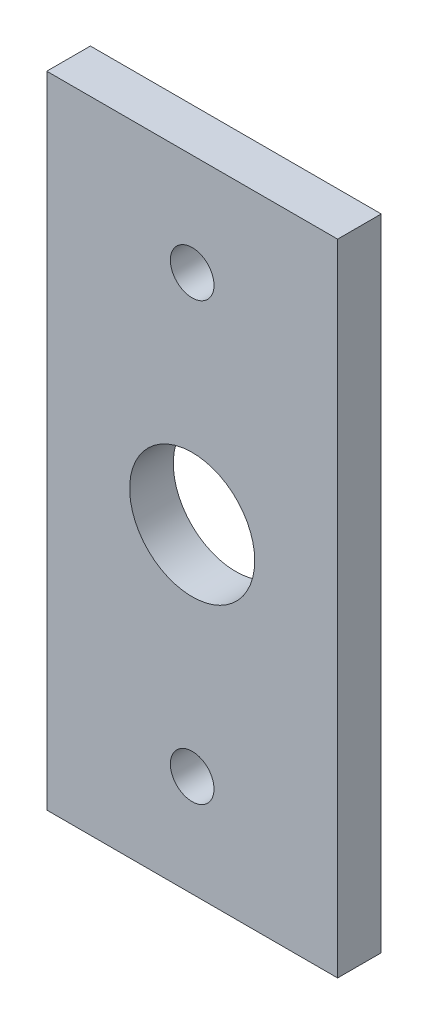
ISO-10303-21;
HEADER;
FILE_DESCRIPTION(('STEP AP214'),'2;1');
FILE_NAME('part.step','',(''),(''),'','','');
FILE_SCHEMA(('AUTOMOTIVE_DESIGN { 1 0 10303 214 1 1 1 1 }'));
ENDSEC;
DATA;
#1=APPLICATION_CONTEXT('core data for automotive mechanical design processes');
#2=APPLICATION_PROTOCOL_DEFINITION('international standard','automotive_design',2000,#1);
#3=PRODUCT_CONTEXT('',#1,'mechanical');
#4=PRODUCT('Part','Part','',(#3));
#5=PRODUCT_RELATED_PRODUCT_CATEGORY('part','',(#4));
#6=PRODUCT_DEFINITION_FORMATION('','',#4);
#7=PRODUCT_DEFINITION_CONTEXT('part definition',#1,'design');
#8=PRODUCT_DEFINITION('design','',#6,#7);
#9=PRODUCT_DEFINITION_SHAPE('','',#8);
#10=(LENGTH_UNIT() NAMED_UNIT(*) SI_UNIT(.MILLI.,.METRE.));
#11=(NAMED_UNIT(*) PLANE_ANGLE_UNIT() SI_UNIT($,.RADIAN.));
#12=(NAMED_UNIT(*) SI_UNIT($,.STERADIAN.) SOLID_ANGLE_UNIT());
#13=UNCERTAINTY_MEASURE_WITH_UNIT(LENGTH_MEASURE(1.E-05),#10,'distance_accuracy_value','');
#14=(GEOMETRIC_REPRESENTATION_CONTEXT(3) GLOBAL_UNCERTAINTY_ASSIGNED_CONTEXT((#13)) GLOBAL_UNIT_ASSIGNED_CONTEXT((#10,
#11,#12)) REPRESENTATION_CONTEXT('',''));
#15=CARTESIAN_POINT('',(0.,0.,0.));
#16=DIRECTION('',(0.,0.,1.));
#17=DIRECTION('',(1.,0.,0.));
#18=AXIS2_PLACEMENT_3D('',#15,#16,#17);
#19=CARTESIAN_POINT('',(0.,0.,3.));
#20=DIRECTION('',(0.,0.,1.));
#21=DIRECTION('',(1.,0.,0.));
#22=AXIS2_PLACEMENT_3D('',#19,#20,#21);
#23=PLANE('',#22);
#24=CARTESIAN_POINT('',(10.,-37.,3.));
#25=DIRECTION('',(0.,0.,1.));
#26=DIRECTION('',(1.,0.,0.));
#27=AXIS2_PLACEMENT_3D('',#24,#25,#26);
#28=CIRCLE('',#27,1.5);
#29=CARTESIAN_POINT('',(11.5,-37.,3.));
#30=VERTEX_POINT('',#29);
#31=EDGE_CURVE('E117',#30,#30,#28,.T.);
#32=ORIENTED_EDGE('',*,*,#31,.F.);
#33=EDGE_LOOP('',(#32));
#34=FACE_BOUND('',#33,.T.);
#35=DIRECTION('',(0.,-1.,0.));
#36=VECTOR('',#35,1.);
#37=CARTESIAN_POINT('',(0.,0.,3.));
#38=LINE('',#37,#36);
#39=CARTESIAN_POINT('',(0.,0.,3.));
#40=VERTEX_POINT('',#39);
#41=CARTESIAN_POINT('',(0.,-44.,3.));
#42=VERTEX_POINT('',#41);
#43=EDGE_CURVE('E87',#40,#42,#38,.T.);
#44=ORIENTED_EDGE('',*,*,#43,.T.);
#45=DIRECTION('',(1.,0.,0.));
#46=VECTOR('',#45,1.);
#47=CARTESIAN_POINT('',(0.,-44.,3.));
#48=LINE('',#47,#46);
#49=CARTESIAN_POINT('',(20.,-44.,3.));
#50=VERTEX_POINT('',#49);
#51=EDGE_CURVE('E82',#42,#50,#48,.T.);
#52=ORIENTED_EDGE('',*,*,#51,.T.);
#53=DIRECTION('',(0.,1.,0.));
#54=VECTOR('',#53,1.);
#55=CARTESIAN_POINT('',(20.,0.,3.));
#56=LINE('',#55,#54);
#57=CARTESIAN_POINT('',(20.,0.,3.));
#58=VERTEX_POINT('',#57);
#59=EDGE_CURVE('E85',#50,#58,#56,.T.);
#60=ORIENTED_EDGE('',*,*,#59,.T.);
#61=DIRECTION('',(-1.,0.,0.));
#62=VECTOR('',#61,1.);
#63=CARTESIAN_POINT('',(0.,0.,3.));
#64=LINE('',#63,#62);
#65=EDGE_CURVE('E52',#58,#40,#64,.T.);
#66=ORIENTED_EDGE('',*,*,#65,.T.);
#67=EDGE_LOOP('',(#44,#52,#60,#66));
#68=FACE_BOUND('',#67,.T.);
#69=CARTESIAN_POINT('',(10.,-7.,3.));
#70=DIRECTION('',(0.,0.,1.));
#71=DIRECTION('',(1.,0.,0.));
#72=AXIS2_PLACEMENT_3D('',#69,#70,#71);
#73=CIRCLE('',#72,1.5);
#74=CARTESIAN_POINT('',(11.5,-7.,3.));
#75=VERTEX_POINT('',#74);
#76=EDGE_CURVE('E102',#75,#75,#73,.T.);
#77=ORIENTED_EDGE('',*,*,#76,.F.);
#78=EDGE_LOOP('',(#77));
#79=FACE_BOUND('',#78,.T.);
#80=CARTESIAN_POINT('',(10.,-22.,3.));
#81=DIRECTION('',(0.,0.,1.));
#82=DIRECTION('',(1.,0.,0.));
#83=AXIS2_PLACEMENT_3D('',#80,#81,#82);
#84=CIRCLE('',#83,4.3);
#85=CARTESIAN_POINT('',(14.3,-22.,3.));
#86=VERTEX_POINT('',#85);
#87=EDGE_CURVE('E123',#86,#86,#84,.T.);
#88=ORIENTED_EDGE('',*,*,#87,.F.);
#89=EDGE_LOOP('',(#88));
#90=FACE_BOUND('',#89,.T.);
#91=ADVANCED_FACE('F35',(#34,#68,#79,#90),#23,.T.);
#92=CARTESIAN_POINT('',(0.,0.,0.));
#93=DIRECTION('',(0.,0.,1.));
#94=DIRECTION('',(1.,0.,0.));
#95=AXIS2_PLACEMENT_3D('',#92,#93,#94);
#96=PLANE('',#95);
#97=CARTESIAN_POINT('',(10.,-37.,0.));
#98=DIRECTION('',(0.,0.,1.));
#99=DIRECTION('',(1.,0.,0.));
#100=AXIS2_PLACEMENT_3D('',#97,#98,#99);
#101=CIRCLE('',#100,1.5);
#102=CARTESIAN_POINT('',(11.5,-37.,0.));
#103=VERTEX_POINT('',#102);
#104=EDGE_CURVE('E120',#103,#103,#101,.T.);
#105=ORIENTED_EDGE('',*,*,#104,.T.);
#106=EDGE_LOOP('',(#105));
#107=FACE_BOUND('',#106,.T.);
#108=DIRECTION('',(0.,-1.,0.));
#109=VECTOR('',#108,1.);
#110=CARTESIAN_POINT('',(0.,0.,0.));
#111=LINE('',#110,#109);
#112=CARTESIAN_POINT('',(0.,0.,0.));
#113=VERTEX_POINT('',#112);
#114=CARTESIAN_POINT('',(0.,-44.,0.));
#115=VERTEX_POINT('',#114);
#116=EDGE_CURVE('E99',#113,#115,#111,.T.);
#117=ORIENTED_EDGE('',*,*,#116,.F.);
#118=DIRECTION('',(-1.,0.,0.));
#119=VECTOR('',#118,1.);
#120=CARTESIAN_POINT('',(0.,0.,0.));
#121=LINE('',#120,#119);
#122=CARTESIAN_POINT('',(20.,0.,0.));
#123=VERTEX_POINT('',#122);
#124=EDGE_CURVE('E75',#123,#113,#121,.T.);
#125=ORIENTED_EDGE('',*,*,#124,.F.);
#126=DIRECTION('',(0.,1.,0.));
#127=VECTOR('',#126,1.);
#128=CARTESIAN_POINT('',(20.,0.,0.));
#129=LINE('',#128,#127);
#130=CARTESIAN_POINT('',(20.,-44.,0.));
#131=VERTEX_POINT('',#130);
#132=EDGE_CURVE('E69',#131,#123,#129,.T.);
#133=ORIENTED_EDGE('',*,*,#132,.F.);
#134=DIRECTION('',(1.,0.,0.));
#135=VECTOR('',#134,1.);
#136=CARTESIAN_POINT('',(0.,-44.,0.));
#137=LINE('',#136,#135);
#138=EDGE_CURVE('E91',#115,#131,#137,.T.);
#139=ORIENTED_EDGE('',*,*,#138,.F.);
#140=EDGE_LOOP('',(#117,#125,#133,#139));
#141=FACE_BOUND('',#140,.T.);
#142=CARTESIAN_POINT('',(10.,-7.,0.));
#143=DIRECTION('',(0.,0.,1.));
#144=DIRECTION('',(1.,0.,0.));
#145=AXIS2_PLACEMENT_3D('',#142,#143,#144);
#146=CIRCLE('',#145,1.5);
#147=CARTESIAN_POINT('',(11.5,-7.,0.));
#148=VERTEX_POINT('',#147);
#149=EDGE_CURVE('E114',#148,#148,#146,.T.);
#150=ORIENTED_EDGE('',*,*,#149,.T.);
#151=EDGE_LOOP('',(#150));
#152=FACE_BOUND('',#151,.T.);
#153=CARTESIAN_POINT('',(10.,-22.,0.));
#154=DIRECTION('',(0.,0.,1.));
#155=DIRECTION('',(1.,0.,0.));
#156=AXIS2_PLACEMENT_3D('',#153,#154,#155);
#157=CIRCLE('',#156,4.3);
#158=CARTESIAN_POINT('',(14.3,-22.,0.));
#159=VERTEX_POINT('',#158);
#160=EDGE_CURVE('E126',#159,#159,#157,.T.);
#161=ORIENTED_EDGE('',*,*,#160,.T.);
#162=EDGE_LOOP('',(#161));
#163=FACE_BOUND('',#162,.T.);
#164=ADVANCED_FACE('F110',(#107,#141,#152,#163),#96,.F.);
#165=CARTESIAN_POINT('',(0.,0.,3.));
#166=DIRECTION('',(1.,0.,0.));
#167=DIRECTION('',(0.,1.,0.));
#168=AXIS2_PLACEMENT_3D('',#165,#166,#167);
#169=PLANE('',#168);
#170=ORIENTED_EDGE('',*,*,#116,.T.);
#171=DIRECTION('',(0.,0.,-1.));
#172=VECTOR('',#171,1.);
#173=CARTESIAN_POINT('',(0.,-44.,3.));
#174=LINE('',#173,#172);
#175=EDGE_CURVE('E11',#42,#115,#174,.T.);
#176=ORIENTED_EDGE('',*,*,#175,.F.);
#177=ORIENTED_EDGE('',*,*,#43,.F.);
#178=DIRECTION('',(0.,0.,-1.));
#179=VECTOR('',#178,1.);
#180=CARTESIAN_POINT('',(0.,0.,3.));
#181=LINE('',#180,#179);
#182=EDGE_CURVE('E95',#40,#113,#181,.T.);
#183=ORIENTED_EDGE('',*,*,#182,.T.);
#184=EDGE_LOOP('',(#170,#176,#177,#183));
#185=FACE_BOUND('',#184,.T.);
#186=ADVANCED_FACE('F37',(#185),#169,.F.);
#187=CARTESIAN_POINT('',(0.,-44.,3.));
#188=DIRECTION('',(0.,1.,0.));
#189=DIRECTION('',(0.,0.,1.));
#190=AXIS2_PLACEMENT_3D('',#187,#188,#189);
#191=PLANE('',#190);
#192=ORIENTED_EDGE('',*,*,#138,.T.);
#193=DIRECTION('',(0.,0.,-1.));
#194=VECTOR('',#193,1.);
#195=CARTESIAN_POINT('',(20.,-44.,3.));
#196=LINE('',#195,#194);
#197=EDGE_CURVE('E44',#50,#131,#196,.T.);
#198=ORIENTED_EDGE('',*,*,#197,.F.);
#199=ORIENTED_EDGE('',*,*,#51,.F.);
#200=ORIENTED_EDGE('',*,*,#175,.T.);
#201=EDGE_LOOP('',(#192,#198,#199,#200));
#202=FACE_BOUND('',#201,.T.);
#203=ADVANCED_FACE('F90',(#202),#191,.F.);
#204=CARTESIAN_POINT('',(20.,0.,3.));
#205=DIRECTION('',(-1.,0.,0.));
#206=DIRECTION('',(0.,-1.,0.));
#207=AXIS2_PLACEMENT_3D('',#204,#205,#206);
#208=PLANE('',#207);
#209=ORIENTED_EDGE('',*,*,#132,.T.);
#210=DIRECTION('',(0.,0.,-1.));
#211=VECTOR('',#210,1.);
#212=CARTESIAN_POINT('',(20.,0.,3.));
#213=LINE('',#212,#211);
#214=EDGE_CURVE('E92',#58,#123,#213,.T.);
#215=ORIENTED_EDGE('',*,*,#214,.F.);
#216=ORIENTED_EDGE('',*,*,#59,.F.);
#217=ORIENTED_EDGE('',*,*,#197,.T.);
#218=EDGE_LOOP('',(#209,#215,#216,#217));
#219=FACE_BOUND('',#218,.T.);
#220=ADVANCED_FACE('F93',(#219),#208,.F.);
#221=CARTESIAN_POINT('',(0.,0.,3.));
#222=DIRECTION('',(0.,-1.,0.));
#223=DIRECTION('',(0.,0.,-1.));
#224=AXIS2_PLACEMENT_3D('',#221,#222,#223);
#225=PLANE('',#224);
#226=ORIENTED_EDGE('',*,*,#124,.T.);
#227=ORIENTED_EDGE('',*,*,#182,.F.);
#228=ORIENTED_EDGE('',*,*,#65,.F.);
#229=ORIENTED_EDGE('',*,*,#214,.T.);
#230=EDGE_LOOP('',(#226,#227,#228,#229));
#231=FACE_BOUND('',#230,.T.);
#232=ADVANCED_FACE('F107',(#231),#225,.F.);
#233=CARTESIAN_POINT('',(10.,-7.,3.));
#234=DIRECTION('',(0.,0.,-1.));
#235=DIRECTION('',(-1.,0.,0.));
#236=AXIS2_PLACEMENT_3D('',#233,#234,#235);
#237=CYLINDRICAL_SURFACE('',#236,1.5);
#238=ORIENTED_EDGE('',*,*,#76,.T.);
#239=EDGE_LOOP('',(#238));
#240=FACE_BOUND('',#239,.T.);
#241=ORIENTED_EDGE('',*,*,#149,.F.);
#242=EDGE_LOOP('',(#241));
#243=FACE_BOUND('',#242,.T.);
#244=ADVANCED_FACE('F145',(#240,#243),#237,.F.);
#245=CARTESIAN_POINT('',(10.,-37.,3.));
#246=DIRECTION('',(0.,0.,-1.));
#247=DIRECTION('',(-1.,0.,0.));
#248=AXIS2_PLACEMENT_3D('',#245,#246,#247);
#249=CYLINDRICAL_SURFACE('',#248,1.5);
#250=ORIENTED_EDGE('',*,*,#31,.T.);
#251=EDGE_LOOP('',(#250));
#252=FACE_BOUND('',#251,.T.);
#253=ORIENTED_EDGE('',*,*,#104,.F.);
#254=EDGE_LOOP('',(#253));
#255=FACE_BOUND('',#254,.T.);
#256=ADVANCED_FACE('F191',(#252,#255),#249,.F.);
#257=CARTESIAN_POINT('',(10.,-22.,3.));
#258=DIRECTION('',(0.,0.,-1.));
#259=DIRECTION('',(-1.,0.,0.));
#260=AXIS2_PLACEMENT_3D('',#257,#258,#259);
#261=CYLINDRICAL_SURFACE('',#260,4.3);
#262=ORIENTED_EDGE('',*,*,#87,.T.);
#263=EDGE_LOOP('',(#262));
#264=FACE_BOUND('',#263,.T.);
#265=ORIENTED_EDGE('',*,*,#160,.F.);
#266=EDGE_LOOP('',(#265));
#267=FACE_BOUND('',#266,.T.);
#268=ADVANCED_FACE('F132',(#264,#267),#261,.F.);
#269=CLOSED_SHELL('',(#91,#164,#186,#203,#220,#232,#244,#256,#268));
#270=MANIFOLD_SOLID_BREP('B2',#269);
#271=ADVANCED_BREP_SHAPE_REPRESENTATION('',(#18,#270),#14);
#272=SHAPE_DEFINITION_REPRESENTATION(#9,#271);
ENDSEC;
END-ISO-10303-21;
